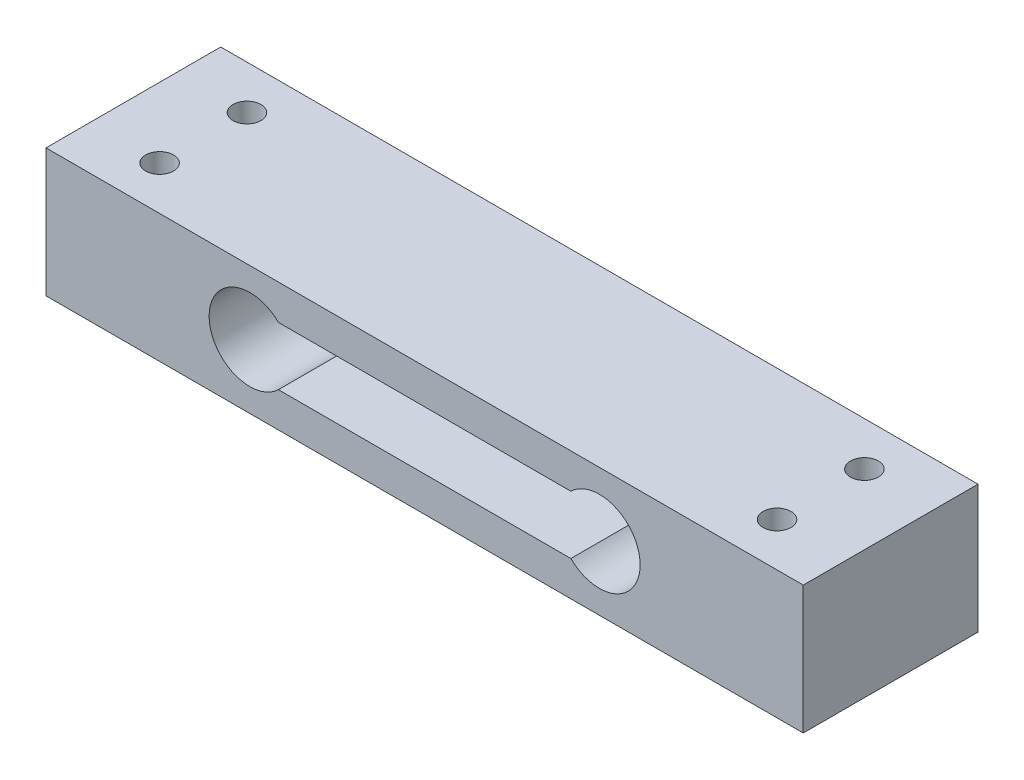
ISO-10303-21;
HEADER;
FILE_DESCRIPTION(('STEP AP214'),'2;1');
FILE_NAME('part.step','',(''),(''),'','','');
FILE_SCHEMA(('AUTOMOTIVE_DESIGN { 1 0 10303 214 1 1 1 1 }'));
ENDSEC;
DATA;
#1=APPLICATION_CONTEXT('core data for automotive mechanical design processes');
#2=APPLICATION_PROTOCOL_DEFINITION('international standard','automotive_design',2000,#1);
#3=PRODUCT_CONTEXT('',#1,'mechanical');
#4=PRODUCT('Part','Part','',(#3));
#5=PRODUCT_RELATED_PRODUCT_CATEGORY('part','',(#4));
#6=PRODUCT_DEFINITION_FORMATION('','',#4);
#7=PRODUCT_DEFINITION_CONTEXT('part definition',#1,'design');
#8=PRODUCT_DEFINITION('design','',#6,#7);
#9=PRODUCT_DEFINITION_SHAPE('','',#8);
#10=(LENGTH_UNIT() NAMED_UNIT(*) SI_UNIT(.MILLI.,.METRE.));
#11=(NAMED_UNIT(*) PLANE_ANGLE_UNIT() SI_UNIT($,.RADIAN.));
#12=(NAMED_UNIT(*) SI_UNIT($,.STERADIAN.) SOLID_ANGLE_UNIT());
#13=UNCERTAINTY_MEASURE_WITH_UNIT(LENGTH_MEASURE(1.E-05),#10,'distance_accuracy_value','');
#14=(GEOMETRIC_REPRESENTATION_CONTEXT(3) GLOBAL_UNCERTAINTY_ASSIGNED_CONTEXT((#13)) GLOBAL_UNIT_ASSIGNED_CONTEXT((#10,
#11,#12)) REPRESENTATION_CONTEXT('',''));
#15=CARTESIAN_POINT('',(0.,0.,0.));
#16=DIRECTION('',(0.,0.,1.));
#17=DIRECTION('',(1.,0.,0.));
#18=AXIS2_PLACEMENT_3D('',#15,#16,#17);
#19=CARTESIAN_POINT('',(65.,-11.,15.));
#20=DIRECTION('',(1.,0.,0.));
#21=DIRECTION('',(0.,0.,-1.));
#22=AXIS2_PLACEMENT_3D('',#19,#20,#21);
#23=PLANE('',#22);
#24=DIRECTION('',(0.,1.,0.));
#25=VECTOR('',#24,1.);
#26=CARTESIAN_POINT('',(65.,-11.,-15.));
#27=LINE('',#26,#25);
#28=CARTESIAN_POINT('',(65.,-11.,-15.));
#29=VERTEX_POINT('',#28);
#30=CARTESIAN_POINT('',(65.,11.,-15.));
#31=VERTEX_POINT('',#30);
#32=EDGE_CURVE('E42',#29,#31,#27,.T.);
#33=ORIENTED_EDGE('',*,*,#32,.T.);
#34=DIRECTION('',(0.,0.,-1.));
#35=VECTOR('',#34,1.);
#36=CARTESIAN_POINT('',(65.,11.,15.));
#37=LINE('',#36,#35);
#38=CARTESIAN_POINT('',(65.,11.,15.));
#39=VERTEX_POINT('',#38);
#40=EDGE_CURVE('E150',#39,#31,#37,.T.);
#41=ORIENTED_EDGE('',*,*,#40,.F.);
#42=DIRECTION('',(0.,1.,0.));
#43=VECTOR('',#42,1.);
#44=CARTESIAN_POINT('',(65.,-11.,15.));
#45=LINE('',#44,#43);
#46=CARTESIAN_POINT('',(65.,-11.,15.));
#47=VERTEX_POINT('',#46);
#48=EDGE_CURVE('E11',#47,#39,#45,.T.);
#49=ORIENTED_EDGE('',*,*,#48,.F.);
#50=DIRECTION('',(0.,0.,-1.));
#51=VECTOR('',#50,1.);
#52=CARTESIAN_POINT('',(65.,-11.,15.));
#53=LINE('',#52,#51);
#54=EDGE_CURVE('E174',#47,#29,#53,.T.);
#55=ORIENTED_EDGE('',*,*,#54,.T.);
#56=EDGE_LOOP('',(#33,#41,#49,#55));
#57=FACE_BOUND('',#56,.T.);
#58=ADVANCED_FACE('F39',(#57),#23,.T.);
#59=CARTESIAN_POINT('',(-65.,-11.,15.));
#60=DIRECTION('',(0.,0.,1.));
#61=DIRECTION('',(1.,0.,0.));
#62=AXIS2_PLACEMENT_3D('',#59,#60,#61);
#63=PLANE('',#62);
#64=CARTESIAN_POINT('',(30.,0.,15.));
#65=DIRECTION('',(0.,0.,1.));
#66=DIRECTION('',(-1.,0.,0.));
#67=AXIS2_PLACEMENT_3D('',#64,#65,#66);
#68=CIRCLE('',#67,7.);
#69=CARTESIAN_POINT('',(25.1010205144336,-5.,15.));
#70=VERTEX_POINT('',#69);
#71=CARTESIAN_POINT('',(25.1010205144336,5.,15.));
#72=VERTEX_POINT('',#71);
#73=EDGE_CURVE('E55',#70,#72,#68,.T.);
#74=ORIENTED_EDGE('',*,*,#73,.F.);
#75=DIRECTION('',(1.,0.,0.));
#76=VECTOR('',#75,1.);
#77=CARTESIAN_POINT('',(-25.1010205144336,-5.,15.));
#78=LINE('',#77,#76);
#79=CARTESIAN_POINT('',(-25.1010205144336,-5.,15.));
#80=VERTEX_POINT('',#79);
#81=EDGE_CURVE('E116',#80,#70,#78,.T.);
#82=ORIENTED_EDGE('',*,*,#81,.F.);
#83=CARTESIAN_POINT('',(-30.,0.,15.));
#84=DIRECTION('',(0.,0.,1.));
#85=DIRECTION('',(1.,0.,0.));
#86=AXIS2_PLACEMENT_3D('',#83,#84,#85);
#87=CIRCLE('',#86,7.);
#88=CARTESIAN_POINT('',(-25.1010205144336,5.,15.));
#89=VERTEX_POINT('',#88);
#90=EDGE_CURVE('E130',#89,#80,#87,.T.);
#91=ORIENTED_EDGE('',*,*,#90,.F.);
#92=DIRECTION('',(-1.,0.,0.));
#93=VECTOR('',#92,1.);
#94=CARTESIAN_POINT('',(-25.1010205144336,5.,15.));
#95=LINE('',#94,#93);
#96=EDGE_CURVE('E123',#72,#89,#95,.T.);
#97=ORIENTED_EDGE('',*,*,#96,.F.);
#98=EDGE_LOOP('',(#74,#82,#91,#97));
#99=FACE_BOUND('',#98,.T.);
#100=ORIENTED_EDGE('',*,*,#48,.T.);
#101=DIRECTION('',(1.,0.,0.));
#102=VECTOR('',#101,1.);
#103=CARTESIAN_POINT('',(-65.,11.,15.));
#104=LINE('',#103,#102);
#105=CARTESIAN_POINT('',(-65.,11.,15.));
#106=VERTEX_POINT('',#105);
#107=EDGE_CURVE('E159',#106,#39,#104,.T.);
#108=ORIENTED_EDGE('',*,*,#107,.F.);
#109=DIRECTION('',(0.,1.,0.));
#110=VECTOR('',#109,1.);
#111=CARTESIAN_POINT('',(-65.,-11.,15.));
#112=LINE('',#111,#110);
#113=CARTESIAN_POINT('',(-65.,-11.,15.));
#114=VERTEX_POINT('',#113);
#115=EDGE_CURVE('E47',#114,#106,#112,.T.);
#116=ORIENTED_EDGE('',*,*,#115,.F.);
#117=DIRECTION('',(1.,0.,0.));
#118=VECTOR('',#117,1.);
#119=CARTESIAN_POINT('',(-65.,-11.,15.));
#120=LINE('',#119,#118);
#121=EDGE_CURVE('E183',#114,#47,#120,.T.);
#122=ORIENTED_EDGE('',*,*,#121,.T.);
#123=EDGE_LOOP('',(#100,#108,#116,#122));
#124=FACE_BOUND('',#123,.T.);
#125=ADVANCED_FACE('F198',(#99,#124),#63,.T.);
#126=CARTESIAN_POINT('',(-65.,-11.,15.));
#127=DIRECTION('',(-1.,0.,0.));
#128=DIRECTION('',(0.,0.,1.));
#129=AXIS2_PLACEMENT_3D('',#126,#127,#128);
#130=PLANE('',#129);
#131=ORIENTED_EDGE('',*,*,#115,.T.);
#132=DIRECTION('',(0.,0.,1.));
#133=VECTOR('',#132,1.);
#134=CARTESIAN_POINT('',(-65.,11.,15.));
#135=LINE('',#134,#133);
#136=CARTESIAN_POINT('',(-65.,11.,-15.));
#137=VERTEX_POINT('',#136);
#138=EDGE_CURVE('E156',#137,#106,#135,.T.);
#139=ORIENTED_EDGE('',*,*,#138,.F.);
#140=DIRECTION('',(0.,1.,0.));
#141=VECTOR('',#140,1.);
#142=CARTESIAN_POINT('',(-65.,-11.,-15.));
#143=LINE('',#142,#141);
#144=CARTESIAN_POINT('',(-65.,-11.,-15.));
#145=VERTEX_POINT('',#144);
#146=EDGE_CURVE('E186',#145,#137,#143,.T.);
#147=ORIENTED_EDGE('',*,*,#146,.F.);
#148=DIRECTION('',(0.,0.,1.));
#149=VECTOR('',#148,1.);
#150=CARTESIAN_POINT('',(-65.,-11.,15.));
#151=LINE('',#150,#149);
#152=EDGE_CURVE('E180',#145,#114,#151,.T.);
#153=ORIENTED_EDGE('',*,*,#152,.T.);
#154=EDGE_LOOP('',(#131,#139,#147,#153));
#155=FACE_BOUND('',#154,.T.);
#156=ADVANCED_FACE('F204',(#155),#130,.T.);
#157=CARTESIAN_POINT('',(-65.,-11.,-15.));
#158=DIRECTION('',(0.,0.,-1.));
#159=DIRECTION('',(-1.,0.,0.));
#160=AXIS2_PLACEMENT_3D('',#157,#158,#159);
#161=PLANE('',#160);
#162=CARTESIAN_POINT('',(30.,0.,-15.));
#163=DIRECTION('',(0.,0.,-1.));
#164=DIRECTION('',(-1.,0.,0.));
#165=AXIS2_PLACEMENT_3D('',#162,#163,#164);
#166=CIRCLE('',#165,7.);
#167=CARTESIAN_POINT('',(25.1010205144336,-5.,-15.));
#168=VERTEX_POINT('',#167);
#169=CARTESIAN_POINT('',(25.1010205144336,5.,-15.));
#170=VERTEX_POINT('',#169);
#171=EDGE_CURVE('E114',#168,#170,#166,.F.);
#172=ORIENTED_EDGE('',*,*,#171,.T.);
#173=DIRECTION('',(-1.,0.,0.));
#174=VECTOR('',#173,1.);
#175=CARTESIAN_POINT('',(-25.1010205144336,5.,-15.));
#176=LINE('',#175,#174);
#177=CARTESIAN_POINT('',(-25.1010205144336,5.,-15.));
#178=VERTEX_POINT('',#177);
#179=EDGE_CURVE('E103',#170,#178,#176,.T.);
#180=ORIENTED_EDGE('',*,*,#179,.T.);
#181=CARTESIAN_POINT('',(-30.,0.,-15.));
#182=DIRECTION('',(0.,0.,-1.));
#183=DIRECTION('',(-1.,0.,0.));
#184=AXIS2_PLACEMENT_3D('',#181,#182,#183);
#185=CIRCLE('',#184,7.);
#186=CARTESIAN_POINT('',(-25.1010205144336,-5.,-15.));
#187=VERTEX_POINT('',#186);
#188=EDGE_CURVE('E125',#178,#187,#185,.F.);
#189=ORIENTED_EDGE('',*,*,#188,.T.);
#190=DIRECTION('',(1.,0.,0.));
#191=VECTOR('',#190,1.);
#192=CARTESIAN_POINT('',(-25.1010205144336,-5.,-15.));
#193=LINE('',#192,#191);
#194=EDGE_CURVE('E121',#187,#168,#193,.T.);
#195=ORIENTED_EDGE('',*,*,#194,.T.);
#196=EDGE_LOOP('',(#172,#180,#189,#195));
#197=FACE_BOUND('',#196,.T.);
#198=ORIENTED_EDGE('',*,*,#146,.T.);
#199=DIRECTION('',(-1.,0.,0.));
#200=VECTOR('',#199,1.);
#201=CARTESIAN_POINT('',(-65.,11.,-15.));
#202=LINE('',#201,#200);
#203=EDGE_CURVE('E153',#31,#137,#202,.T.);
#204=ORIENTED_EDGE('',*,*,#203,.F.);
#205=ORIENTED_EDGE('',*,*,#32,.F.);
#206=DIRECTION('',(-1.,0.,0.));
#207=VECTOR('',#206,1.);
#208=CARTESIAN_POINT('',(-65.,-11.,-15.));
#209=LINE('',#208,#207);
#210=EDGE_CURVE('E177',#29,#145,#209,.T.);
#211=ORIENTED_EDGE('',*,*,#210,.T.);
#212=EDGE_LOOP('',(#198,#204,#205,#211));
#213=FACE_BOUND('',#212,.T.);
#214=ADVANCED_FACE('F119',(#197,#213),#161,.T.);
#215=CARTESIAN_POINT('',(0.,-11.,0.));
#216=DIRECTION('',(0.,-1.,0.));
#217=DIRECTION('',(0.,0.,-1.));
#218=AXIS2_PLACEMENT_3D('',#215,#216,#217);
#219=PLANE('',#218);
#220=CARTESIAN_POINT('',(53.,-11.,-7.5));
#221=DIRECTION('',(0.,1.,0.));
#222=DIRECTION('',(0.,0.,-1.));
#223=AXIS2_PLACEMENT_3D('',#220,#221,#222);
#224=CIRCLE('',#223,2.4);
#225=CARTESIAN_POINT('',(53.,-11.,-9.9));
#226=VERTEX_POINT('',#225);
#227=EDGE_CURVE('E162',#226,#226,#224,.T.);
#228=ORIENTED_EDGE('',*,*,#227,.T.);
#229=EDGE_LOOP('',(#228));
#230=FACE_BOUND('',#229,.T.);
#231=CARTESIAN_POINT('',(53.,-11.,7.5));
#232=DIRECTION('',(0.,1.,0.));
#233=DIRECTION('',(0.,0.,-1.));
#234=AXIS2_PLACEMENT_3D('',#231,#232,#233);
#235=CIRCLE('',#234,2.4);
#236=CARTESIAN_POINT('',(53.,-11.,5.1));
#237=VERTEX_POINT('',#236);
#238=EDGE_CURVE('E165',#237,#237,#235,.T.);
#239=ORIENTED_EDGE('',*,*,#238,.T.);
#240=EDGE_LOOP('',(#239));
#241=FACE_BOUND('',#240,.T.);
#242=CARTESIAN_POINT('',(-53.,-11.,-7.5));
#243=DIRECTION('',(0.,1.,0.));
#244=DIRECTION('',(0.,0.,1.));
#245=AXIS2_PLACEMENT_3D('',#242,#243,#244);
#246=CIRCLE('',#245,2.4);
#247=CARTESIAN_POINT('',(-53.,-11.,-5.1));
#248=VERTEX_POINT('',#247);
#249=EDGE_CURVE('E168',#248,#248,#246,.T.);
#250=ORIENTED_EDGE('',*,*,#249,.T.);
#251=EDGE_LOOP('',(#250));
#252=FACE_BOUND('',#251,.T.);
#253=CARTESIAN_POINT('',(-53.,-11.,7.5));
#254=DIRECTION('',(0.,1.,0.));
#255=DIRECTION('',(0.,0.,1.));
#256=AXIS2_PLACEMENT_3D('',#253,#254,#255);
#257=CIRCLE('',#256,2.4);
#258=CARTESIAN_POINT('',(-53.,-11.,9.9));
#259=VERTEX_POINT('',#258);
#260=EDGE_CURVE('E171',#259,#259,#257,.T.);
#261=ORIENTED_EDGE('',*,*,#260,.T.);
#262=EDGE_LOOP('',(#261));
#263=FACE_BOUND('',#262,.T.);
#264=ORIENTED_EDGE('',*,*,#54,.F.);
#265=ORIENTED_EDGE('',*,*,#121,.F.);
#266=ORIENTED_EDGE('',*,*,#152,.F.);
#267=ORIENTED_EDGE('',*,*,#210,.F.);
#268=EDGE_LOOP('',(#264,#265,#266,#267));
#269=FACE_BOUND('',#268,.T.);
#270=ADVANCED_FACE('F201',(#230,#241,#252,#263,#269),#219,.T.);
#271=CARTESIAN_POINT('',(-53.,-11.,7.5));
#272=DIRECTION('',(0.,1.,0.));
#273=DIRECTION('',(0.,0.,1.));
#274=AXIS2_PLACEMENT_3D('',#271,#272,#273);
#275=CYLINDRICAL_SURFACE('',#274,2.4);
#276=ORIENTED_EDGE('',*,*,#260,.F.);
#277=EDGE_LOOP('',(#276));
#278=FACE_BOUND('',#277,.T.);
#279=CARTESIAN_POINT('',(-53.,11.,7.5));
#280=DIRECTION('',(0.,1.,0.));
#281=DIRECTION('',(0.,0.,1.));
#282=AXIS2_PLACEMENT_3D('',#279,#280,#281);
#283=CIRCLE('',#282,2.4);
#284=CARTESIAN_POINT('',(-53.,11.,9.9));
#285=VERTEX_POINT('',#284);
#286=EDGE_CURVE('E147',#285,#285,#283,.T.);
#287=ORIENTED_EDGE('',*,*,#286,.T.);
#288=EDGE_LOOP('',(#287));
#289=FACE_BOUND('',#288,.T.);
#290=ADVANCED_FACE('F244',(#278,#289),#275,.F.);
#291=CARTESIAN_POINT('',(-53.,-11.,-7.5));
#292=DIRECTION('',(0.,1.,0.));
#293=DIRECTION('',(0.,0.,1.));
#294=AXIS2_PLACEMENT_3D('',#291,#292,#293);
#295=CYLINDRICAL_SURFACE('',#294,2.4);
#296=ORIENTED_EDGE('',*,*,#249,.F.);
#297=EDGE_LOOP('',(#296));
#298=FACE_BOUND('',#297,.T.);
#299=CARTESIAN_POINT('',(-53.,11.,-7.5));
#300=DIRECTION('',(0.,1.,0.));
#301=DIRECTION('',(0.,0.,1.));
#302=AXIS2_PLACEMENT_3D('',#299,#300,#301);
#303=CIRCLE('',#302,2.4);
#304=CARTESIAN_POINT('',(-53.,11.,-5.1));
#305=VERTEX_POINT('',#304);
#306=EDGE_CURVE('E144',#305,#305,#303,.T.);
#307=ORIENTED_EDGE('',*,*,#306,.T.);
#308=EDGE_LOOP('',(#307));
#309=FACE_BOUND('',#308,.T.);
#310=ADVANCED_FACE('F254',(#298,#309),#295,.F.);
#311=CARTESIAN_POINT('',(53.,-11.,7.5));
#312=DIRECTION('',(0.,1.,0.));
#313=DIRECTION('',(0.,0.,1.));
#314=AXIS2_PLACEMENT_3D('',#311,#312,#313);
#315=CYLINDRICAL_SURFACE('',#314,2.4);
#316=ORIENTED_EDGE('',*,*,#238,.F.);
#317=EDGE_LOOP('',(#316));
#318=FACE_BOUND('',#317,.T.);
#319=CARTESIAN_POINT('',(53.,11.,7.5));
#320=DIRECTION('',(0.,1.,0.));
#321=DIRECTION('',(0.,0.,-1.));
#322=AXIS2_PLACEMENT_3D('',#319,#320,#321);
#323=CIRCLE('',#322,2.4);
#324=CARTESIAN_POINT('',(53.,11.,5.1));
#325=VERTEX_POINT('',#324);
#326=EDGE_CURVE('E141',#325,#325,#323,.T.);
#327=ORIENTED_EDGE('',*,*,#326,.T.);
#328=EDGE_LOOP('',(#327));
#329=FACE_BOUND('',#328,.T.);
#330=ADVANCED_FACE('F264',(#318,#329),#315,.F.);
#331=CARTESIAN_POINT('',(53.,-11.,-7.5));
#332=DIRECTION('',(0.,1.,0.));
#333=DIRECTION('',(0.,0.,1.));
#334=AXIS2_PLACEMENT_3D('',#331,#332,#333);
#335=CYLINDRICAL_SURFACE('',#334,2.4);
#336=ORIENTED_EDGE('',*,*,#227,.F.);
#337=EDGE_LOOP('',(#336));
#338=FACE_BOUND('',#337,.T.);
#339=CARTESIAN_POINT('',(53.,11.,-7.5));
#340=DIRECTION('',(0.,1.,0.));
#341=DIRECTION('',(0.,0.,-1.));
#342=AXIS2_PLACEMENT_3D('',#339,#340,#341);
#343=CIRCLE('',#342,2.4);
#344=CARTESIAN_POINT('',(53.,11.,-9.9));
#345=VERTEX_POINT('',#344);
#346=EDGE_CURVE('E110',#345,#345,#343,.T.);
#347=ORIENTED_EDGE('',*,*,#346,.T.);
#348=EDGE_LOOP('',(#347));
#349=FACE_BOUND('',#348,.T.);
#350=ADVANCED_FACE('F274',(#338,#349),#335,.F.);
#351=CARTESIAN_POINT('',(0.,11.,0.));
#352=DIRECTION('',(0.,-1.,0.));
#353=DIRECTION('',(0.,0.,-1.));
#354=AXIS2_PLACEMENT_3D('',#351,#352,#353);
#355=PLANE('',#354);
#356=ORIENTED_EDGE('',*,*,#40,.T.);
#357=ORIENTED_EDGE('',*,*,#203,.T.);
#358=ORIENTED_EDGE('',*,*,#138,.T.);
#359=ORIENTED_EDGE('',*,*,#107,.T.);
#360=EDGE_LOOP('',(#356,#357,#358,#359));
#361=FACE_BOUND('',#360,.T.);
#362=ORIENTED_EDGE('',*,*,#286,.F.);
#363=EDGE_LOOP('',(#362));
#364=FACE_BOUND('',#363,.T.);
#365=ORIENTED_EDGE('',*,*,#306,.F.);
#366=EDGE_LOOP('',(#365));
#367=FACE_BOUND('',#366,.T.);
#368=ORIENTED_EDGE('',*,*,#326,.F.);
#369=EDGE_LOOP('',(#368));
#370=FACE_BOUND('',#369,.T.);
#371=ORIENTED_EDGE('',*,*,#346,.F.);
#372=EDGE_LOOP('',(#371));
#373=FACE_BOUND('',#372,.T.);
#374=ADVANCED_FACE('F194',(#361,#364,#367,#370,#373),#355,.F.);
#375=CARTESIAN_POINT('',(30.,0.,-15.001));
#376=DIRECTION('',(0.,0.,1.));
#377=DIRECTION('',(1.,0.,0.));
#378=AXIS2_PLACEMENT_3D('',#375,#376,#377);
#379=CYLINDRICAL_SURFACE('',#378,7.);
#380=DIRECTION('',(0.,0.,1.));
#381=VECTOR('',#380,1.);
#382=CARTESIAN_POINT('',(25.1010205144336,-5.,-15.001));
#383=LINE('',#382,#381);
#384=EDGE_CURVE('E111',#168,#70,#383,.T.);
#385=ORIENTED_EDGE('',*,*,#384,.T.);
#386=ORIENTED_EDGE('',*,*,#73,.T.);
#387=DIRECTION('',(0.,0.,1.));
#388=VECTOR('',#387,1.);
#389=CARTESIAN_POINT('',(25.1010205144336,5.,-15.001));
#390=LINE('',#389,#388);
#391=EDGE_CURVE('E105',#170,#72,#390,.T.);
#392=ORIENTED_EDGE('',*,*,#391,.F.);
#393=ORIENTED_EDGE('',*,*,#171,.F.);
#394=EDGE_LOOP('',(#385,#386,#392,#393));
#395=FACE_BOUND('',#394,.T.);
#396=ADVANCED_FACE('F113',(#395),#379,.F.);
#397=CARTESIAN_POINT('',(-25.1010205144336,-5.,-15.001));
#398=DIRECTION('',(0.,-1.,0.));
#399=DIRECTION('',(0.,0.,-1.));
#400=AXIS2_PLACEMENT_3D('',#397,#398,#399);
#401=PLANE('',#400);
#402=DIRECTION('',(0.,0.,1.));
#403=VECTOR('',#402,1.);
#404=CARTESIAN_POINT('',(-25.1010205144336,-5.,-15.001));
#405=LINE('',#404,#403);
#406=EDGE_CURVE('E136',#187,#80,#405,.T.);
#407=ORIENTED_EDGE('',*,*,#406,.T.);
#408=ORIENTED_EDGE('',*,*,#81,.T.);
#409=ORIENTED_EDGE('',*,*,#384,.F.);
#410=ORIENTED_EDGE('',*,*,#194,.F.);
#411=EDGE_LOOP('',(#407,#408,#409,#410));
#412=FACE_BOUND('',#411,.T.);
#413=ADVANCED_FACE('F299',(#412),#401,.F.);
#414=CARTESIAN_POINT('',(-30.,0.,-15.001));
#415=DIRECTION('',(0.,0.,1.));
#416=DIRECTION('',(1.,0.,0.));
#417=AXIS2_PLACEMENT_3D('',#414,#415,#416);
#418=CYLINDRICAL_SURFACE('',#417,7.);
#419=DIRECTION('',(0.,0.,1.));
#420=VECTOR('',#419,1.);
#421=CARTESIAN_POINT('',(-25.1010205144336,5.,-15.001));
#422=LINE('',#421,#420);
#423=EDGE_CURVE('E63',#178,#89,#422,.T.);
#424=ORIENTED_EDGE('',*,*,#423,.T.);
#425=ORIENTED_EDGE('',*,*,#90,.T.);
#426=ORIENTED_EDGE('',*,*,#406,.F.);
#427=ORIENTED_EDGE('',*,*,#188,.F.);
#428=EDGE_LOOP('',(#424,#425,#426,#427));
#429=FACE_BOUND('',#428,.T.);
#430=ADVANCED_FACE('F308',(#429),#418,.F.);
#431=CARTESIAN_POINT('',(-25.1010205144336,5.,-15.001));
#432=DIRECTION('',(0.,1.,0.));
#433=DIRECTION('',(0.,0.,1.));
#434=AXIS2_PLACEMENT_3D('',#431,#432,#433);
#435=PLANE('',#434);
#436=ORIENTED_EDGE('',*,*,#391,.T.);
#437=ORIENTED_EDGE('',*,*,#96,.T.);
#438=ORIENTED_EDGE('',*,*,#423,.F.);
#439=ORIENTED_EDGE('',*,*,#179,.F.);
#440=EDGE_LOOP('',(#436,#437,#438,#439));
#441=FACE_BOUND('',#440,.T.);
#442=ADVANCED_FACE('F104',(#441),#435,.F.);
#443=CLOSED_SHELL('',(#58,#125,#156,#214,#270,#290,#310,#330,#350,#374,#396,#413,#430,#442));
#444=MANIFOLD_SOLID_BREP('B2',#443);
#445=ADVANCED_BREP_SHAPE_REPRESENTATION('',(#18,#444),#14);
#446=SHAPE_DEFINITION_REPRESENTATION(#9,#445);
ENDSEC;
END-ISO-10303-21;
